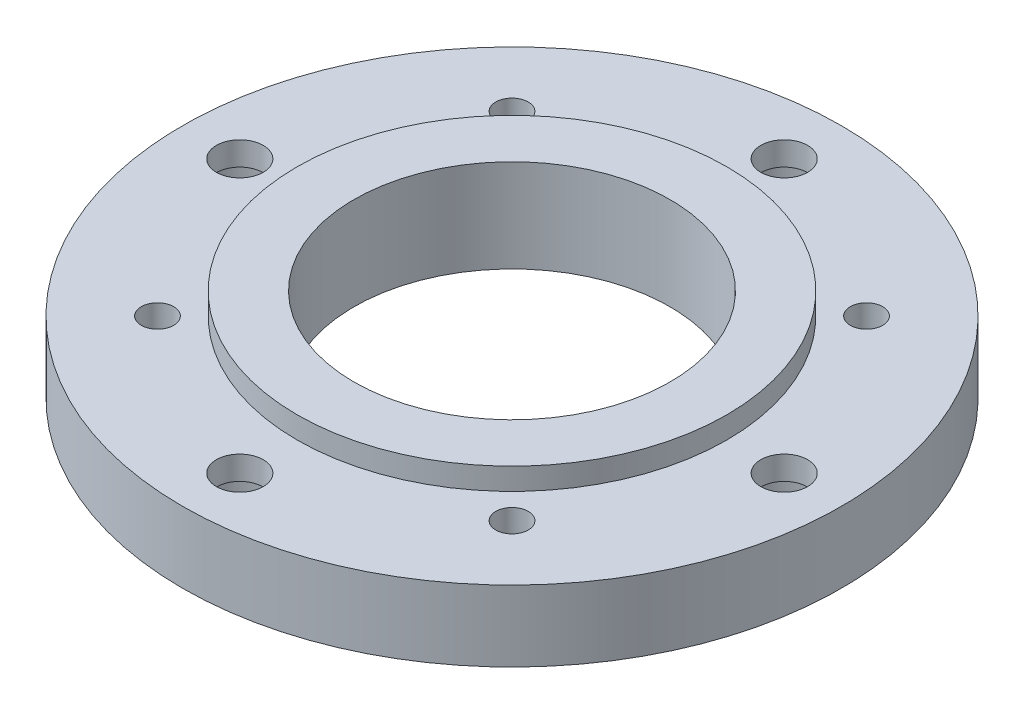
ISO-10303-21;
HEADER;
FILE_DESCRIPTION(('STEP AP214'),'2;1');
FILE_NAME('part.step','',(''),(''),'','','');
FILE_SCHEMA(('AUTOMOTIVE_DESIGN { 1 0 10303 214 1 1 1 1 }'));
ENDSEC;
DATA;
#1=APPLICATION_CONTEXT('core data for automotive mechanical design processes');
#2=APPLICATION_PROTOCOL_DEFINITION('international standard','automotive_design',2000,#1);
#3=PRODUCT_CONTEXT('',#1,'mechanical');
#4=PRODUCT('Part','Part','',(#3));
#5=PRODUCT_RELATED_PRODUCT_CATEGORY('part','',(#4));
#6=PRODUCT_DEFINITION_FORMATION('','',#4);
#7=PRODUCT_DEFINITION_CONTEXT('part definition',#1,'design');
#8=PRODUCT_DEFINITION('design','',#6,#7);
#9=PRODUCT_DEFINITION_SHAPE('','',#8);
#10=(LENGTH_UNIT() NAMED_UNIT(*) SI_UNIT(.MILLI.,.METRE.));
#11=(NAMED_UNIT(*) PLANE_ANGLE_UNIT() SI_UNIT($,.RADIAN.));
#12=(NAMED_UNIT(*) SI_UNIT($,.STERADIAN.) SOLID_ANGLE_UNIT());
#13=UNCERTAINTY_MEASURE_WITH_UNIT(LENGTH_MEASURE(1.E-05),#10,'distance_accuracy_value','');
#14=(GEOMETRIC_REPRESENTATION_CONTEXT(3) GLOBAL_UNCERTAINTY_ASSIGNED_CONTEXT((#13)) GLOBAL_UNIT_ASSIGNED_CONTEXT((#10,
#11,#12)) REPRESENTATION_CONTEXT('',''));
#15=CARTESIAN_POINT('',(0.,0.,0.));
#16=DIRECTION('',(0.,0.,1.));
#17=DIRECTION('',(1.,0.,0.));
#18=AXIS2_PLACEMENT_3D('',#15,#16,#17);
#19=CARTESIAN_POINT('',(0.,4.953,0.));
#20=DIRECTION('',(0.,-1.,0.));
#21=DIRECTION('',(0.,0.,-1.));
#22=AXIS2_PLACEMENT_3D('',#19,#20,#21);
#23=CYLINDRICAL_SURFACE('',#22,22.987);
#24=CARTESIAN_POINT('',(0.,4.953,0.));
#25=DIRECTION('',(0.,1.,0.));
#26=DIRECTION('',(0.,0.,1.));
#27=AXIS2_PLACEMENT_3D('',#24,#25,#26);
#28=CIRCLE('',#27,22.987);
#29=CARTESIAN_POINT('',(0.,4.953,22.987));
#30=VERTEX_POINT('',#29);
#31=EDGE_CURVE('E10',#30,#30,#28,.T.);
#32=ORIENTED_EDGE('',*,*,#31,.F.);
#33=EDGE_LOOP('',(#32));
#34=FACE_BOUND('',#33,.T.);
#35=CARTESIAN_POINT('',(0.,0.,0.));
#36=DIRECTION('',(0.,1.,0.));
#37=DIRECTION('',(0.,0.,1.));
#38=AXIS2_PLACEMENT_3D('',#35,#36,#37);
#39=CIRCLE('',#38,22.987);
#40=CARTESIAN_POINT('',(0.,0.,22.987));
#41=VERTEX_POINT('',#40);
#42=EDGE_CURVE('E63',#41,#41,#39,.T.);
#43=ORIENTED_EDGE('',*,*,#42,.T.);
#44=EDGE_LOOP('',(#43));
#45=FACE_BOUND('',#44,.T.);
#46=ADVANCED_FACE('F49',(#34,#45),#23,.T.);
#47=CARTESIAN_POINT('',(0.,4.953,0.));
#48=DIRECTION('',(0.,-1.,0.));
#49=DIRECTION('',(0.,0.,-1.));
#50=AXIS2_PLACEMENT_3D('',#47,#48,#49);
#51=CYLINDRICAL_SURFACE('',#50,11.0236);
#52=CARTESIAN_POINT('',(0.,0.,0.));
#53=DIRECTION('',(0.,1.,0.));
#54=DIRECTION('',(0.,0.,1.));
#55=AXIS2_PLACEMENT_3D('',#52,#53,#54);
#56=CIRCLE('',#55,11.0236);
#57=CARTESIAN_POINT('',(0.,0.,11.0236));
#58=VERTEX_POINT('',#57);
#59=EDGE_CURVE('E57',#58,#58,#56,.T.);
#60=ORIENTED_EDGE('',*,*,#59,.F.);
#61=EDGE_LOOP('',(#60));
#62=FACE_BOUND('',#61,.T.);
#63=CARTESIAN_POINT('',(0.,6.477,0.));
#64=DIRECTION('',(0.,1.,0.));
#65=DIRECTION('',(0.,0.,1.));
#66=AXIS2_PLACEMENT_3D('',#63,#64,#65);
#67=CIRCLE('',#66,11.0236);
#68=CARTESIAN_POINT('',(0.,6.477,11.0236));
#69=VERTEX_POINT('',#68);
#70=EDGE_CURVE('E153',#69,#69,#67,.T.);
#71=ORIENTED_EDGE('',*,*,#70,.T.);
#72=EDGE_LOOP('',(#71));
#73=FACE_BOUND('',#72,.T.);
#74=ADVANCED_FACE('F184',(#62,#73),#51,.F.);
#75=CARTESIAN_POINT('',(0.,4.953,0.));
#76=DIRECTION('',(0.,1.,0.));
#77=DIRECTION('',(0.,0.,1.));
#78=AXIS2_PLACEMENT_3D('',#75,#76,#77);
#79=PLANE('',#78);
#80=CARTESIAN_POINT('',(0.,4.953,-18.9865));
#81=DIRECTION('',(0.,1.,0.));
#82=DIRECTION('',(0.,0.,1.));
#83=AXIS2_PLACEMENT_3D('',#80,#81,#82);
#84=CIRCLE('',#83,1.63195);
#85=CARTESIAN_POINT('',(0.,4.953,-17.35455));
#86=VERTEX_POINT('',#85);
#87=EDGE_CURVE('E52',#86,#86,#84,.T.);
#88=ORIENTED_EDGE('',*,*,#87,.F.);
#89=EDGE_LOOP('',(#88));
#90=FACE_BOUND('',#89,.T.);
#91=CARTESIAN_POINT('',(-18.9865,4.953,0.));
#92=DIRECTION('',(0.,1.,0.));
#93=DIRECTION('',(0.,0.,1.));
#94=AXIS2_PLACEMENT_3D('',#91,#92,#93);
#95=CIRCLE('',#94,1.63195);
#96=CARTESIAN_POINT('',(-18.9865,4.953,1.63195));
#97=VERTEX_POINT('',#96);
#98=EDGE_CURVE('E83',#97,#97,#95,.T.);
#99=ORIENTED_EDGE('',*,*,#98,.F.);
#100=EDGE_LOOP('',(#99));
#101=FACE_BOUND('',#100,.T.);
#102=CARTESIAN_POINT('',(0.,4.953,18.9865));
#103=DIRECTION('',(0.,1.,0.));
#104=DIRECTION('',(0.,0.,1.));
#105=AXIS2_PLACEMENT_3D('',#102,#103,#104);
#106=CIRCLE('',#105,1.63195);
#107=CARTESIAN_POINT('',(0.,4.953,20.61845));
#108=VERTEX_POINT('',#107);
#109=EDGE_CURVE('E78',#108,#108,#106,.T.);
#110=ORIENTED_EDGE('',*,*,#109,.F.);
#111=EDGE_LOOP('',(#110));
#112=FACE_BOUND('',#111,.T.);
#113=CARTESIAN_POINT('',(18.9865,4.953,0.));
#114=DIRECTION('',(0.,1.,0.));
#115=DIRECTION('',(0.,0.,1.));
#116=AXIS2_PLACEMENT_3D('',#113,#114,#115);
#117=CIRCLE('',#116,1.63195);
#118=CARTESIAN_POINT('',(18.9865,4.953,1.63195));
#119=VERTEX_POINT('',#118);
#120=EDGE_CURVE('E72',#119,#119,#117,.T.);
#121=ORIENTED_EDGE('',*,*,#120,.F.);
#122=EDGE_LOOP('',(#121));
#123=FACE_BOUND('',#122,.T.);
#124=CARTESIAN_POINT('',(-12.3648227292186,4.953,-12.3648227292185));
#125=DIRECTION('',(0.,1.,0.));
#126=DIRECTION('',(0.,0.,1.));
#127=AXIS2_PLACEMENT_3D('',#124,#125,#126);
#128=CIRCLE('',#127,1.13029999999999);
#129=CARTESIAN_POINT('',(-12.3648227292186,4.953,-11.2345227292186));
#130=VERTEX_POINT('',#129);
#131=EDGE_CURVE('E76',#130,#130,#128,.T.);
#132=ORIENTED_EDGE('',*,*,#131,.F.);
#133=EDGE_LOOP('',(#132));
#134=FACE_BOUND('',#133,.T.);
#135=CARTESIAN_POINT('',(12.3648227292185,4.953,-12.3648227292186));
#136=DIRECTION('',(0.,1.,0.));
#137=DIRECTION('',(0.,0.,1.));
#138=AXIS2_PLACEMENT_3D('',#135,#136,#137);
#139=CIRCLE('',#138,1.13029999999999);
#140=CARTESIAN_POINT('',(12.3648227292185,4.953,-11.2345227292186));
#141=VERTEX_POINT('',#140);
#142=EDGE_CURVE('E129',#141,#141,#139,.T.);
#143=ORIENTED_EDGE('',*,*,#142,.F.);
#144=EDGE_LOOP('',(#143));
#145=FACE_BOUND('',#144,.T.);
#146=CARTESIAN_POINT('',(12.3648227292186,4.953,12.3648227292185));
#147=DIRECTION('',(0.,1.,0.));
#148=DIRECTION('',(0.,0.,1.));
#149=AXIS2_PLACEMENT_3D('',#146,#147,#148);
#150=CIRCLE('',#149,1.13029999999999);
#151=CARTESIAN_POINT('',(12.3648227292186,4.953,13.4951227292185));
#152=VERTEX_POINT('',#151);
#153=EDGE_CURVE('E137',#152,#152,#150,.T.);
#154=ORIENTED_EDGE('',*,*,#153,.F.);
#155=EDGE_LOOP('',(#154));
#156=FACE_BOUND('',#155,.T.);
#157=CARTESIAN_POINT('',(-12.3648227292185,4.953,12.3648227292186));
#158=DIRECTION('',(0.,1.,0.));
#159=DIRECTION('',(0.,0.,1.));
#160=AXIS2_PLACEMENT_3D('',#157,#158,#159);
#161=CIRCLE('',#160,1.13029999999999);
#162=CARTESIAN_POINT('',(-12.3648227292185,4.953,13.4951227292186));
#163=VERTEX_POINT('',#162);
#164=EDGE_CURVE('E145',#163,#163,#161,.T.);
#165=ORIENTED_EDGE('',*,*,#164,.F.);
#166=EDGE_LOOP('',(#165));
#167=FACE_BOUND('',#166,.T.);
#168=CARTESIAN_POINT('',(0.,4.953,0.));
#169=DIRECTION('',(0.,1.,0.));
#170=DIRECTION('',(0.,0.,1.));
#171=AXIS2_PLACEMENT_3D('',#168,#169,#170);
#172=CIRCLE('',#171,14.986);
#173=CARTESIAN_POINT('',(0.,4.953,14.986));
#174=VERTEX_POINT('',#173);
#175=EDGE_CURVE('E67',#174,#174,#172,.F.);
#176=ORIENTED_EDGE('',*,*,#175,.T.);
#177=EDGE_LOOP('',(#176));
#178=FACE_BOUND('',#177,.T.);
#179=ORIENTED_EDGE('',*,*,#31,.T.);
#180=EDGE_LOOP('',(#179));
#181=FACE_BOUND('',#180,.T.);
#182=ADVANCED_FACE('F165',(#90,#101,#112,#123,#134,#145,#156,#167,#178,#181),#79,.T.);
#183=CARTESIAN_POINT('',(0.,0.,0.));
#184=DIRECTION('',(0.,1.,0.));
#185=DIRECTION('',(0.,0.,1.));
#186=AXIS2_PLACEMENT_3D('',#183,#184,#185);
#187=PLANE('',#186);
#188=CARTESIAN_POINT('',(0.,0.,-18.9865));
#189=DIRECTION('',(0.,-1.,0.));
#190=DIRECTION('',(0.,0.,-1.));
#191=AXIS2_PLACEMENT_3D('',#188,#189,#190);
#192=CIRCLE('',#191,3.37311999999999);
#193=CARTESIAN_POINT('',(0.,0.,-22.35962));
#194=VERTEX_POINT('',#193);
#195=EDGE_CURVE('E292',#194,#194,#192,.T.);
#196=ORIENTED_EDGE('',*,*,#195,.F.);
#197=EDGE_LOOP('',(#196));
#198=FACE_BOUND('',#197,.T.);
#199=CARTESIAN_POINT('',(-18.9865,0.,0.));
#200=DIRECTION('',(0.,-1.,0.));
#201=DIRECTION('',(0.,0.,-1.));
#202=AXIS2_PLACEMENT_3D('',#199,#200,#201);
#203=CIRCLE('',#202,3.37311999999999);
#204=CARTESIAN_POINT('',(-18.9865,0.,-3.37311999999999));
#205=VERTEX_POINT('',#204);
#206=EDGE_CURVE('E102',#205,#205,#203,.T.);
#207=ORIENTED_EDGE('',*,*,#206,.F.);
#208=EDGE_LOOP('',(#207));
#209=FACE_BOUND('',#208,.T.);
#210=CARTESIAN_POINT('',(0.,0.,18.9865));
#211=DIRECTION('',(0.,-1.,0.));
#212=DIRECTION('',(0.,0.,-1.));
#213=AXIS2_PLACEMENT_3D('',#210,#211,#212);
#214=CIRCLE('',#213,3.37311999999999);
#215=CARTESIAN_POINT('',(0.,0.,15.61338));
#216=VERTEX_POINT('',#215);
#217=EDGE_CURVE('E86',#216,#216,#214,.T.);
#218=ORIENTED_EDGE('',*,*,#217,.F.);
#219=EDGE_LOOP('',(#218));
#220=FACE_BOUND('',#219,.T.);
#221=CARTESIAN_POINT('',(18.9865,0.,0.));
#222=DIRECTION('',(0.,-1.,0.));
#223=DIRECTION('',(0.,0.,-1.));
#224=AXIS2_PLACEMENT_3D('',#221,#222,#223);
#225=CIRCLE('',#224,3.37311999999999);
#226=CARTESIAN_POINT('',(18.9865,0.,-3.37311999999999));
#227=VERTEX_POINT('',#226);
#228=EDGE_CURVE('E81',#227,#227,#225,.T.);
#229=ORIENTED_EDGE('',*,*,#228,.F.);
#230=EDGE_LOOP('',(#229));
#231=FACE_BOUND('',#230,.T.);
#232=CARTESIAN_POINT('',(-12.3648227292186,0.,-12.3648227292185));
#233=DIRECTION('',(0.,1.,0.));
#234=DIRECTION('',(0.,0.,1.));
#235=AXIS2_PLACEMENT_3D('',#232,#233,#234);
#236=CIRCLE('',#235,1.1303);
#237=CARTESIAN_POINT('',(-12.3648227292186,0.,-11.2345227292185));
#238=VERTEX_POINT('',#237);
#239=EDGE_CURVE('E125',#238,#238,#236,.T.);
#240=ORIENTED_EDGE('',*,*,#239,.T.);
#241=EDGE_LOOP('',(#240));
#242=FACE_BOUND('',#241,.T.);
#243=CARTESIAN_POINT('',(12.3648227292185,0.,-12.3648227292186));
#244=DIRECTION('',(0.,1.,0.));
#245=DIRECTION('',(0.,0.,1.));
#246=AXIS2_PLACEMENT_3D('',#243,#244,#245);
#247=CIRCLE('',#246,1.1303);
#248=CARTESIAN_POINT('',(12.3648227292185,0.,-11.2345227292186));
#249=VERTEX_POINT('',#248);
#250=EDGE_CURVE('E133',#249,#249,#247,.T.);
#251=ORIENTED_EDGE('',*,*,#250,.T.);
#252=EDGE_LOOP('',(#251));
#253=FACE_BOUND('',#252,.T.);
#254=CARTESIAN_POINT('',(12.3648227292186,0.,12.3648227292185));
#255=DIRECTION('',(0.,1.,0.));
#256=DIRECTION('',(0.,0.,1.));
#257=AXIS2_PLACEMENT_3D('',#254,#255,#256);
#258=CIRCLE('',#257,1.1303);
#259=CARTESIAN_POINT('',(12.3648227292186,0.,13.4951227292185));
#260=VERTEX_POINT('',#259);
#261=EDGE_CURVE('E141',#260,#260,#258,.T.);
#262=ORIENTED_EDGE('',*,*,#261,.T.);
#263=EDGE_LOOP('',(#262));
#264=FACE_BOUND('',#263,.T.);
#265=CARTESIAN_POINT('',(-12.3648227292185,0.,12.3648227292186));
#266=DIRECTION('',(0.,1.,0.));
#267=DIRECTION('',(0.,0.,1.));
#268=AXIS2_PLACEMENT_3D('',#265,#266,#267);
#269=CIRCLE('',#268,1.1303);
#270=CARTESIAN_POINT('',(-12.3648227292185,0.,13.4951227292186));
#271=VERTEX_POINT('',#270);
#272=EDGE_CURVE('E149',#271,#271,#269,.T.);
#273=ORIENTED_EDGE('',*,*,#272,.T.);
#274=EDGE_LOOP('',(#273));
#275=FACE_BOUND('',#274,.T.);
#276=ORIENTED_EDGE('',*,*,#42,.F.);
#277=EDGE_LOOP('',(#276));
#278=FACE_BOUND('',#277,.T.);
#279=ORIENTED_EDGE('',*,*,#59,.T.);
#280=EDGE_LOOP('',(#279));
#281=FACE_BOUND('',#280,.T.);
#282=ADVANCED_FACE('F171',(#198,#209,#220,#231,#242,#253,#264,#275,#278,#281),#187,.F.);
#283=CARTESIAN_POINT('',(0.,6.477,0.));
#284=DIRECTION('',(0.,-1.,0.));
#285=DIRECTION('',(0.,0.,-1.));
#286=AXIS2_PLACEMENT_3D('',#283,#284,#285);
#287=CYLINDRICAL_SURFACE('',#286,14.986);
#288=ORIENTED_EDGE('',*,*,#175,.F.);
#289=EDGE_LOOP('',(#288));
#290=FACE_BOUND('',#289,.T.);
#291=CARTESIAN_POINT('',(0.,6.477,0.));
#292=DIRECTION('',(0.,1.,0.));
#293=DIRECTION('',(0.,0.,1.));
#294=AXIS2_PLACEMENT_3D('',#291,#292,#293);
#295=CIRCLE('',#294,14.986);
#296=CARTESIAN_POINT('',(0.,6.477,14.986));
#297=VERTEX_POINT('',#296);
#298=EDGE_CURVE('E156',#297,#297,#295,.T.);
#299=ORIENTED_EDGE('',*,*,#298,.F.);
#300=EDGE_LOOP('',(#299));
#301=FACE_BOUND('',#300,.T.);
#302=ADVANCED_FACE('F167',(#290,#301),#287,.T.);
#303=CARTESIAN_POINT('',(0.,6.477,0.));
#304=DIRECTION('',(0.,1.,0.));
#305=DIRECTION('',(0.,0.,1.));
#306=AXIS2_PLACEMENT_3D('',#303,#304,#305);
#307=PLANE('',#306);
#308=ORIENTED_EDGE('',*,*,#70,.F.);
#309=EDGE_LOOP('',(#308));
#310=FACE_BOUND('',#309,.T.);
#311=ORIENTED_EDGE('',*,*,#298,.T.);
#312=EDGE_LOOP('',(#311));
#313=FACE_BOUND('',#312,.T.);
#314=ADVANCED_FACE('F170',(#310,#313),#307,.T.);
#315=CARTESIAN_POINT('',(-12.3648227292185,4.953,12.3648227292186));
#316=DIRECTION('',(0.,1.,0.));
#317=DIRECTION('',(0.,0.,1.));
#318=AXIS2_PLACEMENT_3D('',#315,#316,#317);
#319=CYLINDRICAL_SURFACE('',#318,1.13029999999999);
#320=ORIENTED_EDGE('',*,*,#272,.F.);
#321=EDGE_LOOP('',(#320));
#322=FACE_BOUND('',#321,.T.);
#323=ORIENTED_EDGE('',*,*,#164,.T.);
#324=EDGE_LOOP('',(#323));
#325=FACE_BOUND('',#324,.T.);
#326=ADVANCED_FACE('F177',(#322,#325),#319,.F.);
#327=CARTESIAN_POINT('',(12.3648227292186,4.953,12.3648227292185));
#328=DIRECTION('',(0.,1.,0.));
#329=DIRECTION('',(0.,0.,1.));
#330=AXIS2_PLACEMENT_3D('',#327,#328,#329);
#331=CYLINDRICAL_SURFACE('',#330,1.13029999999999);
#332=ORIENTED_EDGE('',*,*,#261,.F.);
#333=EDGE_LOOP('',(#332));
#334=FACE_BOUND('',#333,.T.);
#335=ORIENTED_EDGE('',*,*,#153,.T.);
#336=EDGE_LOOP('',(#335));
#337=FACE_BOUND('',#336,.T.);
#338=ADVANCED_FACE('F220',(#334,#337),#331,.F.);
#339=CARTESIAN_POINT('',(12.3648227292185,4.953,-12.3648227292186));
#340=DIRECTION('',(0.,1.,0.));
#341=DIRECTION('',(0.,0.,1.));
#342=AXIS2_PLACEMENT_3D('',#339,#340,#341);
#343=CYLINDRICAL_SURFACE('',#342,1.13029999999999);
#344=ORIENTED_EDGE('',*,*,#250,.F.);
#345=EDGE_LOOP('',(#344));
#346=FACE_BOUND('',#345,.T.);
#347=ORIENTED_EDGE('',*,*,#142,.T.);
#348=EDGE_LOOP('',(#347));
#349=FACE_BOUND('',#348,.T.);
#350=ADVANCED_FACE('F226',(#346,#349),#343,.F.);
#351=CARTESIAN_POINT('',(-12.3648227292186,4.953,-12.3648227292185));
#352=DIRECTION('',(0.,1.,0.));
#353=DIRECTION('',(0.,0.,1.));
#354=AXIS2_PLACEMENT_3D('',#351,#352,#353);
#355=CYLINDRICAL_SURFACE('',#354,1.13029999999999);
#356=ORIENTED_EDGE('',*,*,#239,.F.);
#357=EDGE_LOOP('',(#356));
#358=FACE_BOUND('',#357,.T.);
#359=ORIENTED_EDGE('',*,*,#131,.T.);
#360=EDGE_LOOP('',(#359));
#361=FACE_BOUND('',#360,.T.);
#362=ADVANCED_FACE('F233',(#358,#361),#355,.F.);
#363=CARTESIAN_POINT('',(18.9865,0.,0.));
#364=DIRECTION('',(0.,-1.,0.));
#365=DIRECTION('',(0.,0.,-1.));
#366=AXIS2_PLACEMENT_3D('',#363,#364,#365);
#367=CYLINDRICAL_SURFACE('',#366,1.63195);
#368=ORIENTED_EDGE('',*,*,#120,.T.);
#369=EDGE_LOOP('',(#368));
#370=FACE_BOUND('',#369,.T.);
#371=CARTESIAN_POINT('',(18.9865,3.302,0.));
#372=DIRECTION('',(0.,-1.,0.));
#373=DIRECTION('',(0.,0.,-1.));
#374=AXIS2_PLACEMENT_3D('',#371,#372,#373);
#375=CIRCLE('',#374,1.63195);
#376=CARTESIAN_POINT('',(18.9865,3.302,-1.63195));
#377=VERTEX_POINT('',#376);
#378=EDGE_CURVE('E77',#377,#377,#375,.T.);
#379=ORIENTED_EDGE('',*,*,#378,.T.);
#380=EDGE_LOOP('',(#379));
#381=FACE_BOUND('',#380,.T.);
#382=ADVANCED_FACE('F237',(#370,#381),#367,.F.);
#383=CARTESIAN_POINT('',(20.61845,3.302,0.));
#384=DIRECTION('',(0.,1.,0.));
#385=DIRECTION('',(0.,0.,1.));
#386=AXIS2_PLACEMENT_3D('',#383,#384,#385);
#387=PLANE('',#386);
#388=ORIENTED_EDGE('',*,*,#378,.F.);
#389=EDGE_LOOP('',(#388));
#390=FACE_BOUND('',#389,.T.);
#391=CARTESIAN_POINT('',(18.9865,3.302,0.));
#392=DIRECTION('',(0.,-1.,0.));
#393=DIRECTION('',(0.,0.,-1.));
#394=AXIS2_PLACEMENT_3D('',#391,#392,#393);
#395=CIRCLE('',#394,3.37312);
#396=CARTESIAN_POINT('',(18.9865,3.302,-3.37312));
#397=VERTEX_POINT('',#396);
#398=EDGE_CURVE('E115',#397,#397,#395,.T.);
#399=ORIENTED_EDGE('',*,*,#398,.T.);
#400=EDGE_LOOP('',(#399));
#401=FACE_BOUND('',#400,.T.);
#402=ADVANCED_FACE('F241',(#390,#401),#387,.F.);
#403=CARTESIAN_POINT('',(18.9865,0.,0.));
#404=DIRECTION('',(0.,-1.,0.));
#405=DIRECTION('',(0.,0.,-1.));
#406=AXIS2_PLACEMENT_3D('',#403,#404,#405);
#407=CYLINDRICAL_SURFACE('',#406,3.37312);
#408=ORIENTED_EDGE('',*,*,#398,.F.);
#409=EDGE_LOOP('',(#408));
#410=FACE_BOUND('',#409,.T.);
#411=ORIENTED_EDGE('',*,*,#228,.T.);
#412=EDGE_LOOP('',(#411));
#413=FACE_BOUND('',#412,.T.);
#414=ADVANCED_FACE('F245',(#410,#413),#407,.F.);
#415=CARTESIAN_POINT('',(0.,0.,18.9865));
#416=DIRECTION('',(0.,-1.,0.));
#417=DIRECTION('',(0.,0.,-1.));
#418=AXIS2_PLACEMENT_3D('',#415,#416,#417);
#419=CYLINDRICAL_SURFACE('',#418,1.63195);
#420=ORIENTED_EDGE('',*,*,#109,.T.);
#421=EDGE_LOOP('',(#420));
#422=FACE_BOUND('',#421,.T.);
#423=CARTESIAN_POINT('',(0.,3.302,18.9865));
#424=DIRECTION('',(0.,-1.,0.));
#425=DIRECTION('',(0.,0.,-1.));
#426=AXIS2_PLACEMENT_3D('',#423,#424,#425);
#427=CIRCLE('',#426,1.63195);
#428=CARTESIAN_POINT('',(0.,3.302,17.35455));
#429=VERTEX_POINT('',#428);
#430=EDGE_CURVE('E82',#429,#429,#427,.T.);
#431=ORIENTED_EDGE('',*,*,#430,.T.);
#432=EDGE_LOOP('',(#431));
#433=FACE_BOUND('',#432,.T.);
#434=ADVANCED_FACE('F249',(#422,#433),#419,.F.);
#435=CARTESIAN_POINT('',(1.63195,3.302,18.9865));
#436=DIRECTION('',(0.,1.,0.));
#437=DIRECTION('',(0.,0.,1.));
#438=AXIS2_PLACEMENT_3D('',#435,#436,#437);
#439=PLANE('',#438);
#440=ORIENTED_EDGE('',*,*,#430,.F.);
#441=EDGE_LOOP('',(#440));
#442=FACE_BOUND('',#441,.T.);
#443=CARTESIAN_POINT('',(0.,3.302,18.9865));
#444=DIRECTION('',(0.,-1.,0.));
#445=DIRECTION('',(0.,0.,-1.));
#446=AXIS2_PLACEMENT_3D('',#443,#444,#445);
#447=CIRCLE('',#446,3.37312);
#448=CARTESIAN_POINT('',(0.,3.302,15.61338));
#449=VERTEX_POINT('',#448);
#450=EDGE_CURVE('E93',#449,#449,#447,.T.);
#451=ORIENTED_EDGE('',*,*,#450,.T.);
#452=EDGE_LOOP('',(#451));
#453=FACE_BOUND('',#452,.T.);
#454=ADVANCED_FACE('F253',(#442,#453),#439,.F.);
#455=CARTESIAN_POINT('',(0.,0.,18.9865));
#456=DIRECTION('',(0.,-1.,0.));
#457=DIRECTION('',(0.,0.,-1.));
#458=AXIS2_PLACEMENT_3D('',#455,#456,#457);
#459=CYLINDRICAL_SURFACE('',#458,3.37312);
#460=ORIENTED_EDGE('',*,*,#450,.F.);
#461=EDGE_LOOP('',(#460));
#462=FACE_BOUND('',#461,.T.);
#463=ORIENTED_EDGE('',*,*,#217,.T.);
#464=EDGE_LOOP('',(#463));
#465=FACE_BOUND('',#464,.T.);
#466=ADVANCED_FACE('F257',(#462,#465),#459,.F.);
#467=CARTESIAN_POINT('',(-18.9865,0.,0.));
#468=DIRECTION('',(0.,-1.,0.));
#469=DIRECTION('',(0.,0.,-1.));
#470=AXIS2_PLACEMENT_3D('',#467,#468,#469);
#471=CYLINDRICAL_SURFACE('',#470,1.63195);
#472=ORIENTED_EDGE('',*,*,#98,.T.);
#473=EDGE_LOOP('',(#472));
#474=FACE_BOUND('',#473,.T.);
#475=CARTESIAN_POINT('',(-18.9865,3.302,0.));
#476=DIRECTION('',(0.,-1.,0.));
#477=DIRECTION('',(0.,0.,-1.));
#478=AXIS2_PLACEMENT_3D('',#475,#476,#477);
#479=CIRCLE('',#478,1.63195);
#480=CARTESIAN_POINT('',(-18.9865,3.302,-1.63195));
#481=VERTEX_POINT('',#480);
#482=EDGE_CURVE('E87',#481,#481,#479,.T.);
#483=ORIENTED_EDGE('',*,*,#482,.T.);
#484=EDGE_LOOP('',(#483));
#485=FACE_BOUND('',#484,.T.);
#486=ADVANCED_FACE('F261',(#474,#485),#471,.F.);
#487=CARTESIAN_POINT('',(-17.35455,3.302,0.));
#488=DIRECTION('',(0.,1.,0.));
#489=DIRECTION('',(0.,0.,1.));
#490=AXIS2_PLACEMENT_3D('',#487,#488,#489);
#491=PLANE('',#490);
#492=ORIENTED_EDGE('',*,*,#482,.F.);
#493=EDGE_LOOP('',(#492));
#494=FACE_BOUND('',#493,.T.);
#495=CARTESIAN_POINT('',(-18.9865,3.302,0.));
#496=DIRECTION('',(0.,-1.,0.));
#497=DIRECTION('',(0.,0.,-1.));
#498=AXIS2_PLACEMENT_3D('',#495,#496,#497);
#499=CIRCLE('',#498,3.37312);
#500=CARTESIAN_POINT('',(-18.9865,3.302,-3.37312));
#501=VERTEX_POINT('',#500);
#502=EDGE_CURVE('E96',#501,#501,#499,.T.);
#503=ORIENTED_EDGE('',*,*,#502,.T.);
#504=EDGE_LOOP('',(#503));
#505=FACE_BOUND('',#504,.T.);
#506=ADVANCED_FACE('F265',(#494,#505),#491,.F.);
#507=CARTESIAN_POINT('',(-18.9865,0.,0.));
#508=DIRECTION('',(0.,-1.,0.));
#509=DIRECTION('',(0.,0.,-1.));
#510=AXIS2_PLACEMENT_3D('',#507,#508,#509);
#511=CYLINDRICAL_SURFACE('',#510,3.37312);
#512=ORIENTED_EDGE('',*,*,#502,.F.);
#513=EDGE_LOOP('',(#512));
#514=FACE_BOUND('',#513,.T.);
#515=ORIENTED_EDGE('',*,*,#206,.T.);
#516=EDGE_LOOP('',(#515));
#517=FACE_BOUND('',#516,.T.);
#518=ADVANCED_FACE('F268',(#514,#517),#511,.F.);
#519=CARTESIAN_POINT('',(0.,0.,-18.9865));
#520=DIRECTION('',(0.,-1.,0.));
#521=DIRECTION('',(0.,0.,-1.));
#522=AXIS2_PLACEMENT_3D('',#519,#520,#521);
#523=CYLINDRICAL_SURFACE('',#522,1.63195);
#524=ORIENTED_EDGE('',*,*,#87,.T.);
#525=EDGE_LOOP('',(#524));
#526=FACE_BOUND('',#525,.T.);
#527=CARTESIAN_POINT('',(0.,3.302,-18.9865));
#528=DIRECTION('',(0.,-1.,0.));
#529=DIRECTION('',(0.,0.,-1.));
#530=AXIS2_PLACEMENT_3D('',#527,#528,#529);
#531=CIRCLE('',#530,1.63195);
#532=CARTESIAN_POINT('',(0.,3.302,-20.61845));
#533=VERTEX_POINT('',#532);
#534=EDGE_CURVE('E296',#533,#533,#531,.T.);
#535=ORIENTED_EDGE('',*,*,#534,.T.);
#536=EDGE_LOOP('',(#535));
#537=FACE_BOUND('',#536,.T.);
#538=ADVANCED_FACE('F272',(#526,#537),#523,.F.);
#539=CARTESIAN_POINT('',(1.63195,3.302,-18.9865));
#540=DIRECTION('',(0.,1.,0.));
#541=DIRECTION('',(0.,0.,1.));
#542=AXIS2_PLACEMENT_3D('',#539,#540,#541);
#543=PLANE('',#542);
#544=ORIENTED_EDGE('',*,*,#534,.F.);
#545=EDGE_LOOP('',(#544));
#546=FACE_BOUND('',#545,.T.);
#547=CARTESIAN_POINT('',(0.,3.302,-18.9865));
#548=DIRECTION('',(0.,-1.,0.));
#549=DIRECTION('',(0.,0.,-1.));
#550=AXIS2_PLACEMENT_3D('',#547,#548,#549);
#551=CIRCLE('',#550,3.37312);
#552=CARTESIAN_POINT('',(0.,3.302,-22.35962));
#553=VERTEX_POINT('',#552);
#554=EDGE_CURVE('E289',#553,#553,#551,.T.);
#555=ORIENTED_EDGE('',*,*,#554,.T.);
#556=EDGE_LOOP('',(#555));
#557=FACE_BOUND('',#556,.T.);
#558=ADVANCED_FACE('F276',(#546,#557),#543,.F.);
#559=CARTESIAN_POINT('',(0.,0.,-18.9865));
#560=DIRECTION('',(0.,-1.,0.));
#561=DIRECTION('',(0.,0.,-1.));
#562=AXIS2_PLACEMENT_3D('',#559,#560,#561);
#563=CYLINDRICAL_SURFACE('',#562,3.37312);
#564=ORIENTED_EDGE('',*,*,#554,.F.);
#565=EDGE_LOOP('',(#564));
#566=FACE_BOUND('',#565,.T.);
#567=ORIENTED_EDGE('',*,*,#195,.T.);
#568=EDGE_LOOP('',(#567));
#569=FACE_BOUND('',#568,.T.);
#570=ADVANCED_FACE('F280',(#566,#569),#563,.F.);
#571=CLOSED_SHELL('',(#46,#74,#182,#282,#302,#314,#326,#338,#350,#362,#382,#402,#414,#434,#454,
#466,#486,#506,#518,#538,#558,#570));
#572=MANIFOLD_SOLID_BREP('B2',#571);
#573=ADVANCED_BREP_SHAPE_REPRESENTATION('',(#18,#572),#14);
#574=SHAPE_DEFINITION_REPRESENTATION(#9,#573);
ENDSEC;
END-ISO-10303-21;
